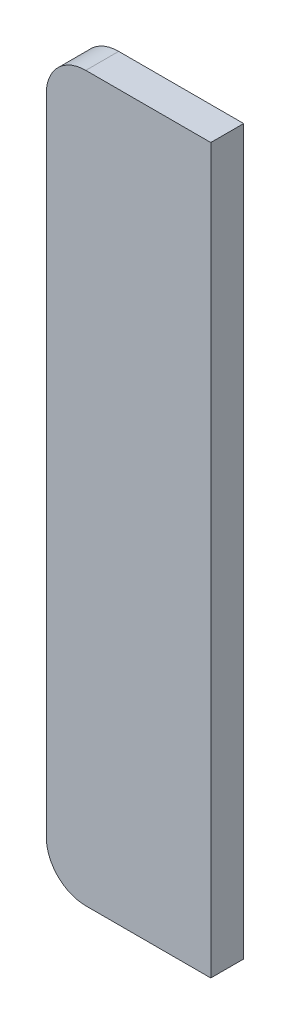
ISO-10303-21;
HEADER;
FILE_DESCRIPTION(('STEP AP214'),'2;1');
FILE_NAME('part.step','',(''),(''),'','','');
FILE_SCHEMA(('AUTOMOTIVE_DESIGN { 1 0 10303 214 1 1 1 1 }'));
ENDSEC;
DATA;
#1=APPLICATION_CONTEXT('core data for automotive mechanical design processes');
#2=APPLICATION_PROTOCOL_DEFINITION('international standard','automotive_design',2000,#1);
#3=PRODUCT_CONTEXT('',#1,'mechanical');
#4=PRODUCT('Part','Part','',(#3));
#5=PRODUCT_RELATED_PRODUCT_CATEGORY('part','',(#4));
#6=PRODUCT_DEFINITION_FORMATION('','',#4);
#7=PRODUCT_DEFINITION_CONTEXT('part definition',#1,'design');
#8=PRODUCT_DEFINITION('design','',#6,#7);
#9=PRODUCT_DEFINITION_SHAPE('','',#8);
#10=(LENGTH_UNIT() NAMED_UNIT(*) SI_UNIT(.MILLI.,.METRE.));
#11=(NAMED_UNIT(*) PLANE_ANGLE_UNIT() SI_UNIT($,.RADIAN.));
#12=(NAMED_UNIT(*) SI_UNIT($,.STERADIAN.) SOLID_ANGLE_UNIT());
#13=UNCERTAINTY_MEASURE_WITH_UNIT(LENGTH_MEASURE(1.E-05),#10,'distance_accuracy_value','');
#14=(GEOMETRIC_REPRESENTATION_CONTEXT(3) GLOBAL_UNCERTAINTY_ASSIGNED_CONTEXT((#13)) GLOBAL_UNIT_ASSIGNED_CONTEXT((#10,
#11,#12)) REPRESENTATION_CONTEXT('',''));
#15=CARTESIAN_POINT('',(0.,0.,0.));
#16=DIRECTION('',(0.,0.,1.));
#17=DIRECTION('',(1.,0.,0.));
#18=AXIS2_PLACEMENT_3D('',#15,#16,#17);
#19=CARTESIAN_POINT('',(30.,30.,25.));
#20=DIRECTION('',(0.,0.,1.));
#21=DIRECTION('',(1.,0.,0.));
#22=AXIS2_PLACEMENT_3D('',#19,#20,#21);
#23=CYLINDRICAL_SURFACE('',#22,30.);
#24=DIRECTION('',(0.,0.,1.));
#25=VECTOR('',#24,1.);
#26=CARTESIAN_POINT('',(0.,30.,25.));
#27=LINE('',#26,#25);
#28=CARTESIAN_POINT('',(0.,30.,0.));
#29=VERTEX_POINT('',#28);
#30=CARTESIAN_POINT('',(0.,30.,25.));
#31=VERTEX_POINT('',#30);
#32=EDGE_CURVE('E151',#29,#31,#27,.T.);
#33=ORIENTED_EDGE('',*,*,#32,.F.);
#34=CARTESIAN_POINT('',(30.,30.,0.));
#35=DIRECTION('',(0.,0.,-1.));
#36=DIRECTION('',(-1.,0.,0.));
#37=AXIS2_PLACEMENT_3D('',#34,#35,#36);
#38=CIRCLE('',#37,30.);
#39=CARTESIAN_POINT('',(30.,0.,0.));
#40=VERTEX_POINT('',#39);
#41=EDGE_CURVE('E51',#40,#29,#38,.T.);
#42=ORIENTED_EDGE('',*,*,#41,.F.);
#43=DIRECTION('',(0.,0.,1.));
#44=VECTOR('',#43,1.);
#45=CARTESIAN_POINT('',(30.,0.,25.));
#46=LINE('',#45,#44);
#47=CARTESIAN_POINT('',(30.,0.,25.));
#48=VERTEX_POINT('',#47);
#49=EDGE_CURVE('E155',#48,#40,#46,.F.);
#50=ORIENTED_EDGE('',*,*,#49,.F.);
#51=CARTESIAN_POINT('',(30.,30.,25.));
#52=DIRECTION('',(0.,0.,-1.));
#53=DIRECTION('',(-1.,0.,0.));
#54=AXIS2_PLACEMENT_3D('',#51,#52,#53);
#55=CIRCLE('',#54,30.);
#56=EDGE_CURVE('E11',#31,#48,#55,.F.);
#57=ORIENTED_EDGE('',*,*,#56,.F.);
#58=EDGE_LOOP('',(#33,#42,#50,#57));
#59=FACE_BOUND('',#58,.T.);
#60=ADVANCED_FACE('F43',(#59),#23,.T.);
#61=CARTESIAN_POINT('',(30.,520.,25.));
#62=DIRECTION('',(0.,0.,1.));
#63=DIRECTION('',(1.,0.,0.));
#64=AXIS2_PLACEMENT_3D('',#61,#62,#63);
#65=CYLINDRICAL_SURFACE('',#64,30.);
#66=DIRECTION('',(0.,0.,1.));
#67=VECTOR('',#66,1.);
#68=CARTESIAN_POINT('',(30.,550.,25.));
#69=LINE('',#68,#67);
#70=CARTESIAN_POINT('',(30.,550.,0.));
#71=VERTEX_POINT('',#70);
#72=CARTESIAN_POINT('',(30.,550.,25.));
#73=VERTEX_POINT('',#72);
#74=EDGE_CURVE('E110',#71,#73,#69,.T.);
#75=ORIENTED_EDGE('',*,*,#74,.F.);
#76=CARTESIAN_POINT('',(30.,520.,0.));
#77=DIRECTION('',(0.,0.,-1.));
#78=DIRECTION('',(-1.,0.,0.));
#79=AXIS2_PLACEMENT_3D('',#76,#77,#78);
#80=CIRCLE('',#79,30.);
#81=CARTESIAN_POINT('',(0.,520.,0.));
#82=VERTEX_POINT('',#81);
#83=EDGE_CURVE('E145',#82,#71,#80,.T.);
#84=ORIENTED_EDGE('',*,*,#83,.F.);
#85=DIRECTION('',(0.,0.,1.));
#86=VECTOR('',#85,1.);
#87=CARTESIAN_POINT('',(0.,520.,25.));
#88=LINE('',#87,#86);
#89=CARTESIAN_POINT('',(0.,520.,25.));
#90=VERTEX_POINT('',#89);
#91=EDGE_CURVE('E141',#90,#82,#88,.F.);
#92=ORIENTED_EDGE('',*,*,#91,.F.);
#93=CARTESIAN_POINT('',(30.,520.,25.));
#94=DIRECTION('',(0.,0.,-1.));
#95=DIRECTION('',(-1.,0.,0.));
#96=AXIS2_PLACEMENT_3D('',#93,#94,#95);
#97=CIRCLE('',#96,30.);
#98=EDGE_CURVE('E148',#73,#90,#97,.F.);
#99=ORIENTED_EDGE('',*,*,#98,.F.);
#100=EDGE_LOOP('',(#75,#84,#92,#99));
#101=FACE_BOUND('',#100,.T.);
#102=ADVANCED_FACE('F167',(#101),#65,.T.);
#103=CARTESIAN_POINT('',(0.,0.,25.));
#104=DIRECTION('',(1.,0.,0.));
#105=DIRECTION('',(0.,0.,-1.));
#106=AXIS2_PLACEMENT_3D('',#103,#104,#105);
#107=PLANE('',#106);
#108=DIRECTION('',(0.,-1.,0.));
#109=VECTOR('',#108,1.);
#110=CARTESIAN_POINT('',(0.,0.,0.));
#111=LINE('',#110,#109);
#112=EDGE_CURVE('E123',#82,#29,#111,.T.);
#113=ORIENTED_EDGE('',*,*,#112,.T.);
#114=ORIENTED_EDGE('',*,*,#32,.T.);
#115=DIRECTION('',(0.,-1.,0.));
#116=VECTOR('',#115,1.);
#117=CARTESIAN_POINT('',(0.,0.,25.));
#118=LINE('',#117,#116);
#119=EDGE_CURVE('E100',#90,#31,#118,.T.);
#120=ORIENTED_EDGE('',*,*,#119,.F.);
#121=ORIENTED_EDGE('',*,*,#91,.T.);
#122=EDGE_LOOP('',(#113,#114,#120,#121));
#123=FACE_BOUND('',#122,.T.);
#124=ADVANCED_FACE('F163',(#123),#107,.F.);
#125=CARTESIAN_POINT('',(0.,0.,25.));
#126=DIRECTION('',(0.,1.,0.));
#127=DIRECTION('',(0.,0.,1.));
#128=AXIS2_PLACEMENT_3D('',#125,#126,#127);
#129=PLANE('',#128);
#130=DIRECTION('',(1.,0.,0.));
#131=VECTOR('',#130,1.);
#132=CARTESIAN_POINT('',(0.,0.,25.));
#133=LINE('',#132,#131);
#134=CARTESIAN_POINT('',(125.,0.,25.));
#135=VERTEX_POINT('',#134);
#136=EDGE_CURVE('E91',#48,#135,#133,.T.);
#137=ORIENTED_EDGE('',*,*,#136,.F.);
#138=ORIENTED_EDGE('',*,*,#49,.T.);
#139=DIRECTION('',(1.,0.,0.));
#140=VECTOR('',#139,1.);
#141=CARTESIAN_POINT('',(0.,0.,0.));
#142=LINE('',#141,#140);
#143=CARTESIAN_POINT('',(125.,0.,0.));
#144=VERTEX_POINT('',#143);
#145=EDGE_CURVE('E106',#40,#144,#142,.T.);
#146=ORIENTED_EDGE('',*,*,#145,.T.);
#147=DIRECTION('',(0.,0.,-1.));
#148=VECTOR('',#147,1.);
#149=CARTESIAN_POINT('',(125.,0.,25.));
#150=LINE('',#149,#148);
#151=EDGE_CURVE('E103',#135,#144,#150,.T.);
#152=ORIENTED_EDGE('',*,*,#151,.F.);
#153=EDGE_LOOP('',(#137,#138,#146,#152));
#154=FACE_BOUND('',#153,.T.);
#155=ADVANCED_FACE('F104',(#154),#129,.F.);
#156=CARTESIAN_POINT('',(125.,0.,25.));
#157=DIRECTION('',(-1.,0.,0.));
#158=DIRECTION('',(0.,0.,1.));
#159=AXIS2_PLACEMENT_3D('',#156,#157,#158);
#160=PLANE('',#159);
#161=DIRECTION('',(0.,1.,0.));
#162=VECTOR('',#161,1.);
#163=CARTESIAN_POINT('',(125.,0.,0.));
#164=LINE('',#163,#162);
#165=CARTESIAN_POINT('',(125.,550.,0.));
#166=VERTEX_POINT('',#165);
#167=EDGE_CURVE('E129',#144,#166,#164,.T.);
#168=ORIENTED_EDGE('',*,*,#167,.T.);
#169=DIRECTION('',(0.,0.,-1.));
#170=VECTOR('',#169,1.);
#171=CARTESIAN_POINT('',(125.,550.,25.));
#172=LINE('',#171,#170);
#173=CARTESIAN_POINT('',(125.,550.,25.));
#174=VERTEX_POINT('',#173);
#175=EDGE_CURVE('E111',#174,#166,#172,.T.);
#176=ORIENTED_EDGE('',*,*,#175,.F.);
#177=DIRECTION('',(0.,1.,0.));
#178=VECTOR('',#177,1.);
#179=CARTESIAN_POINT('',(125.,0.,25.));
#180=LINE('',#179,#178);
#181=EDGE_CURVE('E96',#135,#174,#180,.T.);
#182=ORIENTED_EDGE('',*,*,#181,.F.);
#183=ORIENTED_EDGE('',*,*,#151,.T.);
#184=EDGE_LOOP('',(#168,#176,#182,#183));
#185=FACE_BOUND('',#184,.T.);
#186=ADVANCED_FACE('F113',(#185),#160,.F.);
#187=CARTESIAN_POINT('',(0.,550.,25.));
#188=DIRECTION('',(0.,-1.,0.));
#189=DIRECTION('',(0.,0.,-1.));
#190=AXIS2_PLACEMENT_3D('',#187,#188,#189);
#191=PLANE('',#190);
#192=DIRECTION('',(-1.,0.,0.));
#193=VECTOR('',#192,1.);
#194=CARTESIAN_POINT('',(0.,550.,0.));
#195=LINE('',#194,#193);
#196=EDGE_CURVE('E132',#166,#71,#195,.T.);
#197=ORIENTED_EDGE('',*,*,#196,.T.);
#198=ORIENTED_EDGE('',*,*,#74,.T.);
#199=DIRECTION('',(-1.,0.,0.));
#200=VECTOR('',#199,1.);
#201=CARTESIAN_POINT('',(0.,550.,25.));
#202=LINE('',#201,#200);
#203=EDGE_CURVE('E117',#174,#73,#202,.T.);
#204=ORIENTED_EDGE('',*,*,#203,.F.);
#205=ORIENTED_EDGE('',*,*,#175,.T.);
#206=EDGE_LOOP('',(#197,#198,#204,#205));
#207=FACE_BOUND('',#206,.T.);
#208=ADVANCED_FACE('F170',(#207),#191,.F.);
#209=CARTESIAN_POINT('',(0.,0.,25.));
#210=DIRECTION('',(0.,0.,-1.));
#211=DIRECTION('',(-1.,0.,0.));
#212=AXIS2_PLACEMENT_3D('',#209,#210,#211);
#213=PLANE('',#212);
#214=ORIENTED_EDGE('',*,*,#119,.T.);
#215=ORIENTED_EDGE('',*,*,#56,.T.);
#216=ORIENTED_EDGE('',*,*,#136,.T.);
#217=ORIENTED_EDGE('',*,*,#181,.T.);
#218=ORIENTED_EDGE('',*,*,#203,.T.);
#219=ORIENTED_EDGE('',*,*,#98,.T.);
#220=EDGE_LOOP('',(#214,#215,#216,#217,#218,#219));
#221=FACE_BOUND('',#220,.T.);
#222=ADVANCED_FACE('F93',(#221),#213,.F.);
#223=CARTESIAN_POINT('',(0.,0.,0.));
#224=DIRECTION('',(0.,0.,-1.));
#225=DIRECTION('',(-1.,0.,0.));
#226=AXIS2_PLACEMENT_3D('',#223,#224,#225);
#227=PLANE('',#226);
#228=ORIENTED_EDGE('',*,*,#145,.F.);
#229=ORIENTED_EDGE('',*,*,#41,.T.);
#230=ORIENTED_EDGE('',*,*,#112,.F.);
#231=ORIENTED_EDGE('',*,*,#83,.T.);
#232=ORIENTED_EDGE('',*,*,#196,.F.);
#233=ORIENTED_EDGE('',*,*,#167,.F.);
#234=EDGE_LOOP('',(#228,#229,#230,#231,#232,#233));
#235=FACE_BOUND('',#234,.T.);
#236=ADVANCED_FACE('F160',(#235),#227,.T.);
#237=CLOSED_SHELL('',(#60,#102,#124,#155,#186,#208,#222,#236));
#238=MANIFOLD_SOLID_BREP('B2',#237);
#239=ADVANCED_BREP_SHAPE_REPRESENTATION('',(#18,#238),#14);
#240=SHAPE_DEFINITION_REPRESENTATION(#9,#239);
ENDSEC;
END-ISO-10303-21;
